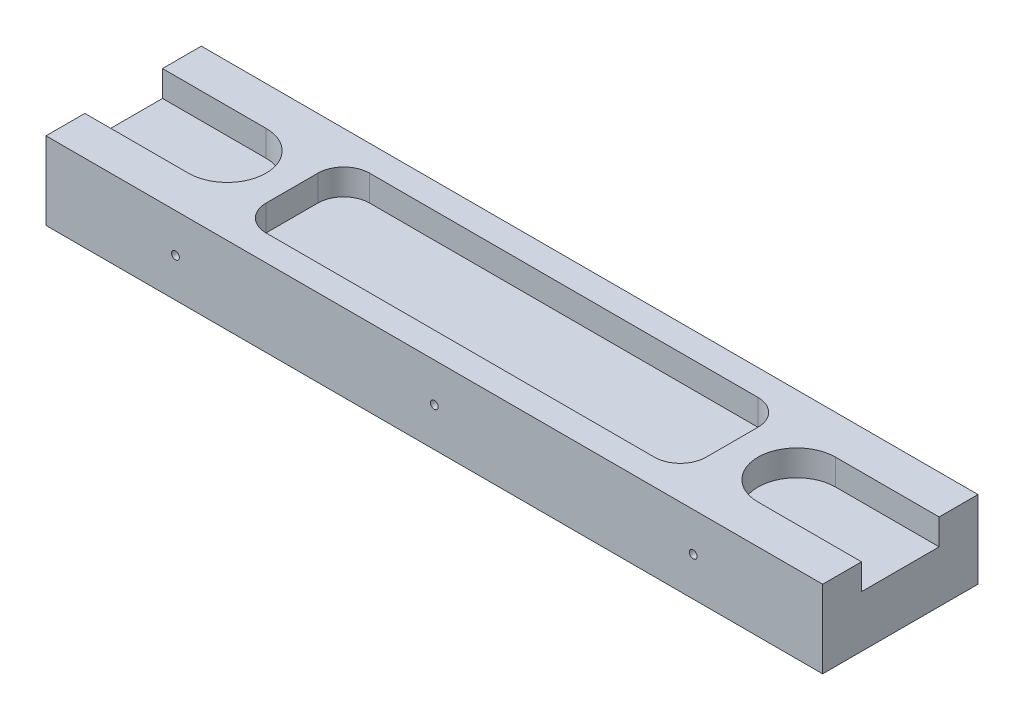
ISO-10303-21;
HEADER;
FILE_DESCRIPTION(('STEP AP214'),'2;1');
FILE_NAME('part.step','',(''),(''),'','','');
FILE_SCHEMA(('AUTOMOTIVE_DESIGN { 1 0 10303 214 1 1 1 1 }'));
ENDSEC;
DATA;
#1=APPLICATION_CONTEXT('core data for automotive mechanical design processes');
#2=APPLICATION_PROTOCOL_DEFINITION('international standard','automotive_design',2000,#1);
#3=PRODUCT_CONTEXT('',#1,'mechanical');
#4=PRODUCT('Part','Part','',(#3));
#5=PRODUCT_RELATED_PRODUCT_CATEGORY('part','',(#4));
#6=PRODUCT_DEFINITION_FORMATION('','',#4);
#7=PRODUCT_DEFINITION_CONTEXT('part definition',#1,'design');
#8=PRODUCT_DEFINITION('design','',#6,#7);
#9=PRODUCT_DEFINITION_SHAPE('','',#8);
#10=(LENGTH_UNIT() NAMED_UNIT(*) SI_UNIT(.MILLI.,.METRE.));
#11=(NAMED_UNIT(*) PLANE_ANGLE_UNIT() SI_UNIT($,.RADIAN.));
#12=(NAMED_UNIT(*) SI_UNIT($,.STERADIAN.) SOLID_ANGLE_UNIT());
#13=UNCERTAINTY_MEASURE_WITH_UNIT(LENGTH_MEASURE(1.E-05),#10,'distance_accuracy_value','');
#14=(GEOMETRIC_REPRESENTATION_CONTEXT(3) GLOBAL_UNCERTAINTY_ASSIGNED_CONTEXT((#13)) GLOBAL_UNIT_ASSIGNED_CONTEXT((#10,
#11,#12)) REPRESENTATION_CONTEXT('',''));
#15=CARTESIAN_POINT('',(0.,0.,0.));
#16=DIRECTION('',(0.,0.,1.));
#17=DIRECTION('',(1.,0.,0.));
#18=AXIS2_PLACEMENT_3D('',#15,#16,#17);
#19=CARTESIAN_POINT('',(0.,15.,0.));
#20=DIRECTION('',(1.,0.,0.));
#21=DIRECTION('',(0.,0.,-1.));
#22=AXIS2_PLACEMENT_3D('',#19,#20,#21);
#23=PLANE('',#22);
#24=DIRECTION('',(0.,0.,1.));
#25=VECTOR('',#24,1.);
#26=CARTESIAN_POINT('',(0.,10.,0.));
#27=LINE('',#26,#25);
#28=CARTESIAN_POINT('',(0.,10.,-22.5));
#29=VERTEX_POINT('',#28);
#30=CARTESIAN_POINT('',(0.,10.,-7.5));
#31=VERTEX_POINT('',#30);
#32=EDGE_CURVE('E11',#29,#31,#27,.T.);
#33=ORIENTED_EDGE('',*,*,#32,.F.);
#34=DIRECTION('',(0.,1.,0.));
#35=VECTOR('',#34,1.);
#36=CARTESIAN_POINT('',(0.,15.,-22.5));
#37=LINE('',#36,#35);
#38=CARTESIAN_POINT('',(0.,15.,-22.5));
#39=VERTEX_POINT('',#38);
#40=EDGE_CURVE('E306',#29,#39,#37,.T.);
#41=ORIENTED_EDGE('',*,*,#40,.T.);
#42=DIRECTION('',(0.,0.,1.));
#43=VECTOR('',#42,1.);
#44=CARTESIAN_POINT('',(0.,15.,0.));
#45=LINE('',#44,#43);
#46=CARTESIAN_POINT('',(0.,15.,-30.));
#47=VERTEX_POINT('',#46);
#48=EDGE_CURVE('E310',#47,#39,#45,.T.);
#49=ORIENTED_EDGE('',*,*,#48,.F.);
#50=DIRECTION('',(0.,-1.,0.));
#51=VECTOR('',#50,1.);
#52=CARTESIAN_POINT('',(0.,15.,-30.));
#53=LINE('',#52,#51);
#54=CARTESIAN_POINT('',(0.,0.,-30.));
#55=VERTEX_POINT('',#54);
#56=EDGE_CURVE('E322',#47,#55,#53,.T.);
#57=ORIENTED_EDGE('',*,*,#56,.T.);
#58=DIRECTION('',(0.,0.,1.));
#59=VECTOR('',#58,1.);
#60=CARTESIAN_POINT('',(0.,0.,0.));
#61=LINE('',#60,#59);
#62=CARTESIAN_POINT('',(0.,0.,0.));
#63=VERTEX_POINT('',#62);
#64=EDGE_CURVE('E309',#55,#63,#61,.T.);
#65=ORIENTED_EDGE('',*,*,#64,.T.);
#66=DIRECTION('',(0.,-1.,0.));
#67=VECTOR('',#66,1.);
#68=CARTESIAN_POINT('',(0.,15.,0.));
#69=LINE('',#68,#67);
#70=CARTESIAN_POINT('',(0.,15.,0.));
#71=VERTEX_POINT('',#70);
#72=EDGE_CURVE('E339',#71,#63,#69,.T.);
#73=ORIENTED_EDGE('',*,*,#72,.F.);
#74=CARTESIAN_POINT('',(0.,15.,-7.50000000000001));
#75=VERTEX_POINT('',#74);
#76=EDGE_CURVE('E314',#75,#71,#45,.T.);
#77=ORIENTED_EDGE('',*,*,#76,.F.);
#78=DIRECTION('',(0.,-1.,0.));
#79=VECTOR('',#78,1.);
#80=CARTESIAN_POINT('',(0.,15.,-7.5));
#81=LINE('',#80,#79);
#82=EDGE_CURVE('E303',#75,#31,#81,.T.);
#83=ORIENTED_EDGE('',*,*,#82,.T.);
#84=EDGE_LOOP('',(#33,#41,#49,#57,#65,#73,#77,#83));
#85=FACE_BOUND('',#84,.T.);
#86=ADVANCED_FACE('F39',(#85),#23,.F.);
#87=CARTESIAN_POINT('',(0.,15.,0.));
#88=DIRECTION('',(0.,0.,-1.));
#89=DIRECTION('',(-1.,0.,0.));
#90=AXIS2_PLACEMENT_3D('',#87,#88,#89);
#91=PLANE('',#90);
#92=CARTESIAN_POINT('',(25.,7.5,0.));
#93=DIRECTION('',(0.,0.,1.));
#94=DIRECTION('',(1.,0.,0.));
#95=AXIS2_PLACEMENT_3D('',#92,#93,#94);
#96=CIRCLE('',#95,0.750000000000002);
#97=CARTESIAN_POINT('',(25.75,7.5,0.));
#98=VERTEX_POINT('',#97);
#99=EDGE_CURVE('E246',#98,#98,#96,.T.);
#100=ORIENTED_EDGE('',*,*,#99,.F.);
#101=EDGE_LOOP('',(#100));
#102=FACE_BOUND('',#101,.T.);
#103=CARTESIAN_POINT('',(75.,7.5,0.));
#104=DIRECTION('',(0.,0.,1.));
#105=DIRECTION('',(1.,0.,0.));
#106=AXIS2_PLACEMENT_3D('',#103,#104,#105);
#107=CIRCLE('',#106,0.749999999999999);
#108=CARTESIAN_POINT('',(75.75,7.5,0.));
#109=VERTEX_POINT('',#108);
#110=EDGE_CURVE('E250',#109,#109,#107,.T.);
#111=ORIENTED_EDGE('',*,*,#110,.F.);
#112=EDGE_LOOP('',(#111));
#113=FACE_BOUND('',#112,.T.);
#114=CARTESIAN_POINT('',(125.,7.5,0.));
#115=DIRECTION('',(0.,0.,1.));
#116=DIRECTION('',(1.,0.,0.));
#117=AXIS2_PLACEMENT_3D('',#114,#115,#116);
#118=CIRCLE('',#117,0.750000000000012);
#119=CARTESIAN_POINT('',(125.75,7.5,0.));
#120=VERTEX_POINT('',#119);
#121=EDGE_CURVE('E257',#120,#120,#118,.T.);
#122=ORIENTED_EDGE('',*,*,#121,.F.);
#123=EDGE_LOOP('',(#122));
#124=FACE_BOUND('',#123,.T.);
#125=DIRECTION('',(1.,0.,0.));
#126=VECTOR('',#125,1.);
#127=CARTESIAN_POINT('',(0.,0.,0.));
#128=LINE('',#127,#126);
#129=CARTESIAN_POINT('',(150.,0.,0.));
#130=VERTEX_POINT('',#129);
#131=EDGE_CURVE('E325',#63,#130,#128,.T.);
#132=ORIENTED_EDGE('',*,*,#131,.T.);
#133=DIRECTION('',(0.,-1.,0.));
#134=VECTOR('',#133,1.);
#135=CARTESIAN_POINT('',(150.,15.,0.));
#136=LINE('',#135,#134);
#137=CARTESIAN_POINT('',(150.,15.,0.));
#138=VERTEX_POINT('',#137);
#139=EDGE_CURVE('E336',#138,#130,#136,.T.);
#140=ORIENTED_EDGE('',*,*,#139,.F.);
#141=DIRECTION('',(1.,0.,0.));
#142=VECTOR('',#141,1.);
#143=CARTESIAN_POINT('',(0.,15.,0.));
#144=LINE('',#143,#142);
#145=EDGE_CURVE('E313',#71,#138,#144,.T.);
#146=ORIENTED_EDGE('',*,*,#145,.F.);
#147=ORIENTED_EDGE('',*,*,#72,.T.);
#148=EDGE_LOOP('',(#132,#140,#146,#147));
#149=FACE_BOUND('',#148,.T.);
#150=ADVANCED_FACE('F395',(#102,#113,#124,#149),#91,.F.);
#151=CARTESIAN_POINT('',(150.,15.,0.));
#152=DIRECTION('',(-1.,0.,0.));
#153=DIRECTION('',(0.,0.,1.));
#154=AXIS2_PLACEMENT_3D('',#151,#152,#153);
#155=PLANE('',#154);
#156=DIRECTION('',(0.,0.,1.));
#157=VECTOR('',#156,1.);
#158=CARTESIAN_POINT('',(150.,10.,0.));
#159=LINE('',#158,#157);
#160=CARTESIAN_POINT('',(150.,10.,-22.5));
#161=VERTEX_POINT('',#160);
#162=CARTESIAN_POINT('',(150.,10.,-7.5));
#163=VERTEX_POINT('',#162);
#164=EDGE_CURVE('E46',#161,#163,#159,.T.);
#165=ORIENTED_EDGE('',*,*,#164,.T.);
#166=DIRECTION('',(0.,1.,0.));
#167=VECTOR('',#166,1.);
#168=CARTESIAN_POINT('',(150.,15.,-7.5));
#169=LINE('',#168,#167);
#170=CARTESIAN_POINT('',(150.,15.,-7.5));
#171=VERTEX_POINT('',#170);
#172=EDGE_CURVE('E300',#163,#171,#169,.T.);
#173=ORIENTED_EDGE('',*,*,#172,.T.);
#174=DIRECTION('',(0.,0.,-1.));
#175=VECTOR('',#174,1.);
#176=CARTESIAN_POINT('',(150.,15.,0.));
#177=LINE('',#176,#175);
#178=EDGE_CURVE('E317',#138,#171,#177,.T.);
#179=ORIENTED_EDGE('',*,*,#178,.F.);
#180=ORIENTED_EDGE('',*,*,#139,.T.);
#181=DIRECTION('',(0.,0.,-1.));
#182=VECTOR('',#181,1.);
#183=CARTESIAN_POINT('',(150.,0.,0.));
#184=LINE('',#183,#182);
#185=CARTESIAN_POINT('',(150.,0.,-30.));
#186=VERTEX_POINT('',#185);
#187=EDGE_CURVE('E327',#130,#186,#184,.T.);
#188=ORIENTED_EDGE('',*,*,#187,.T.);
#189=DIRECTION('',(0.,-1.,0.));
#190=VECTOR('',#189,1.);
#191=CARTESIAN_POINT('',(150.,15.,-30.));
#192=LINE('',#191,#190);
#193=CARTESIAN_POINT('',(150.,15.,-30.));
#194=VERTEX_POINT('',#193);
#195=EDGE_CURVE('E333',#194,#186,#192,.T.);
#196=ORIENTED_EDGE('',*,*,#195,.F.);
#197=CARTESIAN_POINT('',(150.,15.,-22.5));
#198=VERTEX_POINT('',#197);
#199=EDGE_CURVE('E316',#198,#194,#177,.T.);
#200=ORIENTED_EDGE('',*,*,#199,.F.);
#201=DIRECTION('',(0.,-1.,0.));
#202=VECTOR('',#201,1.);
#203=CARTESIAN_POINT('',(150.,15.,-22.5));
#204=LINE('',#203,#202);
#205=EDGE_CURVE('E61',#198,#161,#204,.T.);
#206=ORIENTED_EDGE('',*,*,#205,.T.);
#207=EDGE_LOOP('',(#165,#173,#179,#180,#188,#196,#200,#206));
#208=FACE_BOUND('',#207,.T.);
#209=ADVANCED_FACE('F348',(#208),#155,.F.);
#210=CARTESIAN_POINT('',(0.,15.,-30.));
#211=DIRECTION('',(0.,0.,1.));
#212=DIRECTION('',(1.,0.,0.));
#213=AXIS2_PLACEMENT_3D('',#210,#211,#212);
#214=PLANE('',#213);
#215=CARTESIAN_POINT('',(25.,7.5,-30.));
#216=DIRECTION('',(0.,0.,1.));
#217=DIRECTION('',(1.,0.,0.));
#218=AXIS2_PLACEMENT_3D('',#215,#216,#217);
#219=CIRCLE('',#218,0.750000000000002);
#220=CARTESIAN_POINT('',(25.75,7.5,-30.));
#221=VERTEX_POINT('',#220);
#222=EDGE_CURVE('E249',#221,#221,#219,.F.);
#223=ORIENTED_EDGE('',*,*,#222,.F.);
#224=EDGE_LOOP('',(#223));
#225=FACE_BOUND('',#224,.T.);
#226=CARTESIAN_POINT('',(75.,7.5,-30.));
#227=DIRECTION('',(0.,0.,1.));
#228=DIRECTION('',(1.,0.,0.));
#229=AXIS2_PLACEMENT_3D('',#226,#227,#228);
#230=CIRCLE('',#229,0.749999999999999);
#231=CARTESIAN_POINT('',(75.75,7.5,-30.));
#232=VERTEX_POINT('',#231);
#233=EDGE_CURVE('E254',#232,#232,#230,.F.);
#234=ORIENTED_EDGE('',*,*,#233,.F.);
#235=EDGE_LOOP('',(#234));
#236=FACE_BOUND('',#235,.T.);
#237=CARTESIAN_POINT('',(125.,7.5,-30.));
#238=DIRECTION('',(0.,0.,1.));
#239=DIRECTION('',(1.,0.,0.));
#240=AXIS2_PLACEMENT_3D('',#237,#238,#239);
#241=CIRCLE('',#240,0.750000000000012);
#242=CARTESIAN_POINT('',(125.75,7.5,-30.));
#243=VERTEX_POINT('',#242);
#244=EDGE_CURVE('E234',#243,#243,#241,.F.);
#245=ORIENTED_EDGE('',*,*,#244,.F.);
#246=EDGE_LOOP('',(#245));
#247=FACE_BOUND('',#246,.T.);
#248=DIRECTION('',(-1.,0.,0.));
#249=VECTOR('',#248,1.);
#250=CARTESIAN_POINT('',(0.,0.,-30.));
#251=LINE('',#250,#249);
#252=EDGE_CURVE('E329',#186,#55,#251,.T.);
#253=ORIENTED_EDGE('',*,*,#252,.T.);
#254=ORIENTED_EDGE('',*,*,#56,.F.);
#255=DIRECTION('',(-1.,0.,0.));
#256=VECTOR('',#255,1.);
#257=CARTESIAN_POINT('',(0.,15.,-30.));
#258=LINE('',#257,#256);
#259=EDGE_CURVE('E320',#194,#47,#258,.T.);
#260=ORIENTED_EDGE('',*,*,#259,.F.);
#261=ORIENTED_EDGE('',*,*,#195,.T.);
#262=EDGE_LOOP('',(#253,#254,#260,#261));
#263=FACE_BOUND('',#262,.T.);
#264=ADVANCED_FACE('F376',(#225,#236,#247,#263),#214,.F.);
#265=CARTESIAN_POINT('',(0.,15.,0.));
#266=DIRECTION('',(0.,-1.,0.));
#267=DIRECTION('',(0.,0.,-1.));
#268=AXIS2_PLACEMENT_3D('',#265,#266,#267);
#269=PLANE('',#268);
#270=DIRECTION('',(-1.,0.,0.));
#271=VECTOR('',#270,1.);
#272=CARTESIAN_POINT('',(37.5,15.,-25.));
#273=LINE('',#272,#271);
#274=CARTESIAN_POINT('',(112.5,15.,-25.));
#275=VERTEX_POINT('',#274);
#276=CARTESIAN_POINT('',(37.5,15.,-25.));
#277=VERTEX_POINT('',#276);
#278=EDGE_CURVE('E216',#275,#277,#273,.T.);
#279=ORIENTED_EDGE('',*,*,#278,.F.);
#280=CARTESIAN_POINT('',(112.5,15.,-20.));
#281=DIRECTION('',(0.,1.,0.));
#282=DIRECTION('',(0.,0.,-1.));
#283=AXIS2_PLACEMENT_3D('',#280,#281,#282);
#284=CIRCLE('',#283,5.);
#285=CARTESIAN_POINT('',(117.5,15.,-20.));
#286=VERTEX_POINT('',#285);
#287=EDGE_CURVE('E53',#286,#275,#284,.T.);
#288=ORIENTED_EDGE('',*,*,#287,.F.);
#289=DIRECTION('',(0.,0.,-1.));
#290=VECTOR('',#289,1.);
#291=CARTESIAN_POINT('',(117.5,15.,-20.));
#292=LINE('',#291,#290);
#293=CARTESIAN_POINT('',(117.5,15.,-10.));
#294=VERTEX_POINT('',#293);
#295=EDGE_CURVE('E196',#294,#286,#292,.T.);
#296=ORIENTED_EDGE('',*,*,#295,.F.);
#297=CARTESIAN_POINT('',(112.5,15.,-10.));
#298=DIRECTION('',(0.,1.,0.));
#299=DIRECTION('',(0.,0.,1.));
#300=AXIS2_PLACEMENT_3D('',#297,#298,#299);
#301=CIRCLE('',#300,5.);
#302=CARTESIAN_POINT('',(112.5,15.,-5.));
#303=VERTEX_POINT('',#302);
#304=EDGE_CURVE('E199',#303,#294,#301,.T.);
#305=ORIENTED_EDGE('',*,*,#304,.F.);
#306=DIRECTION('',(1.,0.,0.));
#307=VECTOR('',#306,1.);
#308=CARTESIAN_POINT('',(37.5,15.,-5.));
#309=LINE('',#308,#307);
#310=CARTESIAN_POINT('',(37.5,15.,-5.));
#311=VERTEX_POINT('',#310);
#312=EDGE_CURVE('E227',#311,#303,#309,.T.);
#313=ORIENTED_EDGE('',*,*,#312,.F.);
#314=CARTESIAN_POINT('',(37.5,15.,-10.));
#315=DIRECTION('',(0.,1.,0.));
#316=DIRECTION('',(0.,0.,1.));
#317=AXIS2_PLACEMENT_3D('',#314,#315,#316);
#318=CIRCLE('',#317,5.);
#319=CARTESIAN_POINT('',(32.5,15.,-10.));
#320=VERTEX_POINT('',#319);
#321=EDGE_CURVE('E224',#320,#311,#318,.T.);
#322=ORIENTED_EDGE('',*,*,#321,.F.);
#323=DIRECTION('',(0.,0.,1.));
#324=VECTOR('',#323,1.);
#325=CARTESIAN_POINT('',(32.5,15.,-20.));
#326=LINE('',#325,#324);
#327=CARTESIAN_POINT('',(32.5,15.,-20.));
#328=VERTEX_POINT('',#327);
#329=EDGE_CURVE('E221',#328,#320,#326,.T.);
#330=ORIENTED_EDGE('',*,*,#329,.F.);
#331=CARTESIAN_POINT('',(37.5,15.,-20.));
#332=DIRECTION('',(0.,1.,0.));
#333=DIRECTION('',(0.,0.,1.));
#334=AXIS2_PLACEMENT_3D('',#331,#332,#333);
#335=CIRCLE('',#334,5.);
#336=EDGE_CURVE('E218',#277,#328,#335,.T.);
#337=ORIENTED_EDGE('',*,*,#336,.F.);
#338=EDGE_LOOP('',(#279,#288,#296,#305,#313,#322,#330,#337));
#339=FACE_BOUND('',#338,.T.);
#340=ORIENTED_EDGE('',*,*,#48,.T.);
#341=DIRECTION('',(-1.,0.,0.));
#342=VECTOR('',#341,1.);
#343=CARTESIAN_POINT('',(-20.,15.,-22.5));
#344=LINE('',#343,#342);
#345=CARTESIAN_POINT('',(20.,15.,-22.5));
#346=VERTEX_POINT('',#345);
#347=EDGE_CURVE('E267',#346,#39,#344,.T.);
#348=ORIENTED_EDGE('',*,*,#347,.F.);
#349=CARTESIAN_POINT('',(20.,15.,-15.));
#350=DIRECTION('',(0.,1.,0.));
#351=DIRECTION('',(0.,0.,1.));
#352=AXIS2_PLACEMENT_3D('',#349,#350,#351);
#353=CIRCLE('',#352,7.5);
#354=CARTESIAN_POINT('',(20.,15.,-7.50000000000001));
#355=VERTEX_POINT('',#354);
#356=EDGE_CURVE('E274',#355,#346,#353,.T.);
#357=ORIENTED_EDGE('',*,*,#356,.F.);
#358=DIRECTION('',(-1.,0.,0.));
#359=VECTOR('',#358,1.);
#360=CARTESIAN_POINT('',(0.,15.,-7.5));
#361=LINE('',#360,#359);
#362=EDGE_CURVE('E344',#355,#75,#361,.T.);
#363=ORIENTED_EDGE('',*,*,#362,.T.);
#364=ORIENTED_EDGE('',*,*,#76,.T.);
#365=ORIENTED_EDGE('',*,*,#145,.T.);
#366=ORIENTED_EDGE('',*,*,#178,.T.);
#367=DIRECTION('',(1.,0.,0.));
#368=VECTOR('',#367,1.);
#369=CARTESIAN_POINT('',(170.,15.,-7.5));
#370=LINE('',#369,#368);
#371=CARTESIAN_POINT('',(130.,15.,-7.50000000000001));
#372=VERTEX_POINT('',#371);
#373=EDGE_CURVE('E288',#372,#171,#370,.T.);
#374=ORIENTED_EDGE('',*,*,#373,.F.);
#375=CARTESIAN_POINT('',(130.,15.,-15.));
#376=DIRECTION('',(0.,1.,0.));
#377=DIRECTION('',(0.,0.,-1.));
#378=AXIS2_PLACEMENT_3D('',#375,#376,#377);
#379=CIRCLE('',#378,7.5);
#380=CARTESIAN_POINT('',(130.,15.,-22.5));
#381=VERTEX_POINT('',#380);
#382=EDGE_CURVE('E277',#381,#372,#379,.T.);
#383=ORIENTED_EDGE('',*,*,#382,.F.);
#384=DIRECTION('',(1.,0.,0.));
#385=VECTOR('',#384,1.);
#386=CARTESIAN_POINT('',(0.,15.,-22.5));
#387=LINE('',#386,#385);
#388=EDGE_CURVE('E342',#381,#198,#387,.T.);
#389=ORIENTED_EDGE('',*,*,#388,.T.);
#390=ORIENTED_EDGE('',*,*,#199,.T.);
#391=ORIENTED_EDGE('',*,*,#259,.T.);
#392=EDGE_LOOP('',(#340,#348,#357,#363,#364,#365,#366,#374,#383,#389,#390,#391));
#393=FACE_BOUND('',#392,.T.);
#394=ADVANCED_FACE('F364',(#339,#393),#269,.F.);
#395=CARTESIAN_POINT('',(0.,0.,0.));
#396=DIRECTION('',(0.,-1.,0.));
#397=DIRECTION('',(0.,0.,-1.));
#398=AXIS2_PLACEMENT_3D('',#395,#396,#397);
#399=PLANE('',#398);
#400=ORIENTED_EDGE('',*,*,#64,.F.);
#401=ORIENTED_EDGE('',*,*,#252,.F.);
#402=ORIENTED_EDGE('',*,*,#187,.F.);
#403=ORIENTED_EDGE('',*,*,#131,.F.);
#404=EDGE_LOOP('',(#400,#401,#402,#403));
#405=FACE_BOUND('',#404,.T.);
#406=ADVANCED_FACE('F373',(#405),#399,.T.);
#407=CARTESIAN_POINT('',(170.,10.,-15.));
#408=DIRECTION('',(0.,-1.,0.));
#409=DIRECTION('',(0.,0.,-1.));
#410=AXIS2_PLACEMENT_3D('',#407,#408,#409);
#411=PLANE('',#410);
#412=DIRECTION('',(-1.,0.,0.));
#413=VECTOR('',#412,1.);
#414=CARTESIAN_POINT('',(170.,10.,-22.5));
#415=LINE('',#414,#413);
#416=CARTESIAN_POINT('',(130.,10.,-22.5));
#417=VERTEX_POINT('',#416);
#418=EDGE_CURVE('E290',#161,#417,#415,.T.);
#419=ORIENTED_EDGE('',*,*,#418,.T.);
#420=CARTESIAN_POINT('',(130.,10.,-15.));
#421=DIRECTION('',(0.,1.,0.));
#422=DIRECTION('',(0.,0.,-1.));
#423=AXIS2_PLACEMENT_3D('',#420,#421,#422);
#424=CIRCLE('',#423,7.5);
#425=CARTESIAN_POINT('',(130.,10.,-7.50000000000001));
#426=VERTEX_POINT('',#425);
#427=EDGE_CURVE('E295',#417,#426,#424,.T.);
#428=ORIENTED_EDGE('',*,*,#427,.T.);
#429=DIRECTION('',(1.,0.,0.));
#430=VECTOR('',#429,1.);
#431=CARTESIAN_POINT('',(170.,10.,-7.5));
#432=LINE('',#431,#430);
#433=EDGE_CURVE('E286',#426,#163,#432,.T.);
#434=ORIENTED_EDGE('',*,*,#433,.T.);
#435=ORIENTED_EDGE('',*,*,#164,.F.);
#436=EDGE_LOOP('',(#419,#428,#434,#435));
#437=FACE_BOUND('',#436,.T.);
#438=ADVANCED_FACE('F352',(#437),#411,.F.);
#439=CARTESIAN_POINT('',(170.,10.,-7.5));
#440=DIRECTION('',(0.,0.,1.));
#441=DIRECTION('',(1.,0.,0.));
#442=AXIS2_PLACEMENT_3D('',#439,#440,#441);
#443=PLANE('',#442);
#444=ORIENTED_EDGE('',*,*,#433,.F.);
#445=DIRECTION('',(0.,1.,0.));
#446=VECTOR('',#445,1.);
#447=CARTESIAN_POINT('',(130.,10.,-7.50000000000001));
#448=LINE('',#447,#446);
#449=EDGE_CURVE('E253',#426,#372,#448,.T.);
#450=ORIENTED_EDGE('',*,*,#449,.T.);
#451=ORIENTED_EDGE('',*,*,#373,.T.);
#452=ORIENTED_EDGE('',*,*,#172,.F.);
#453=EDGE_LOOP('',(#444,#450,#451,#452));
#454=FACE_BOUND('',#453,.T.);
#455=ADVANCED_FACE('F361',(#454),#443,.F.);
#456=CARTESIAN_POINT('',(170.,10.,-22.5));
#457=DIRECTION('',(0.,0.,-1.));
#458=DIRECTION('',(-1.,0.,0.));
#459=AXIS2_PLACEMENT_3D('',#456,#457,#458);
#460=PLANE('',#459);
#461=ORIENTED_EDGE('',*,*,#388,.F.);
#462=DIRECTION('',(0.,1.,0.));
#463=VECTOR('',#462,1.);
#464=CARTESIAN_POINT('',(130.,10.,-22.5));
#465=LINE('',#464,#463);
#466=EDGE_CURVE('E283',#417,#381,#465,.T.);
#467=ORIENTED_EDGE('',*,*,#466,.F.);
#468=ORIENTED_EDGE('',*,*,#418,.F.);
#469=ORIENTED_EDGE('',*,*,#205,.F.);
#470=EDGE_LOOP('',(#461,#467,#468,#469));
#471=FACE_BOUND('',#470,.T.);
#472=ADVANCED_FACE('F355',(#471),#460,.F.);
#473=CARTESIAN_POINT('',(130.,10.,-15.));
#474=DIRECTION('',(0.,1.,0.));
#475=DIRECTION('',(0.,0.,1.));
#476=AXIS2_PLACEMENT_3D('',#473,#474,#475);
#477=CYLINDRICAL_SURFACE('',#476,7.5);
#478=ORIENTED_EDGE('',*,*,#382,.T.);
#479=ORIENTED_EDGE('',*,*,#449,.F.);
#480=ORIENTED_EDGE('',*,*,#427,.F.);
#481=ORIENTED_EDGE('',*,*,#466,.T.);
#482=EDGE_LOOP('',(#478,#479,#480,#481));
#483=FACE_BOUND('',#482,.T.);
#484=ADVANCED_FACE('F359',(#483),#477,.F.);
#485=CARTESIAN_POINT('',(-20.,10.,-15.));
#486=DIRECTION('',(0.,1.,0.));
#487=DIRECTION('',(0.,0.,1.));
#488=AXIS2_PLACEMENT_3D('',#485,#486,#487);
#489=PLANE('',#488);
#490=ORIENTED_EDGE('',*,*,#32,.T.);
#491=DIRECTION('',(1.,0.,0.));
#492=VECTOR('',#491,1.);
#493=CARTESIAN_POINT('',(-20.,10.,-7.5));
#494=LINE('',#493,#492);
#495=CARTESIAN_POINT('',(20.,10.,-7.50000000000001));
#496=VERTEX_POINT('',#495);
#497=EDGE_CURVE('E264',#31,#496,#494,.T.);
#498=ORIENTED_EDGE('',*,*,#497,.T.);
#499=CARTESIAN_POINT('',(20.,10.,-15.));
#500=DIRECTION('',(0.,1.,0.));
#501=DIRECTION('',(0.,0.,1.));
#502=AXIS2_PLACEMENT_3D('',#499,#500,#501);
#503=CIRCLE('',#502,7.5);
#504=CARTESIAN_POINT('',(20.,10.,-22.5));
#505=VERTEX_POINT('',#504);
#506=EDGE_CURVE('E266',#496,#505,#503,.T.);
#507=ORIENTED_EDGE('',*,*,#506,.T.);
#508=DIRECTION('',(-1.,0.,0.));
#509=VECTOR('',#508,1.);
#510=CARTESIAN_POINT('',(-20.,10.,-22.5));
#511=LINE('',#510,#509);
#512=EDGE_CURVE('E270',#505,#29,#511,.T.);
#513=ORIENTED_EDGE('',*,*,#512,.T.);
#514=EDGE_LOOP('',(#490,#498,#507,#513));
#515=FACE_BOUND('',#514,.T.);
#516=ADVANCED_FACE('F421',(#515),#489,.T.);
#517=CARTESIAN_POINT('',(-20.,10.,-22.5));
#518=DIRECTION('',(0.,0.,-1.));
#519=DIRECTION('',(-1.,0.,0.));
#520=AXIS2_PLACEMENT_3D('',#517,#518,#519);
#521=PLANE('',#520);
#522=ORIENTED_EDGE('',*,*,#512,.F.);
#523=DIRECTION('',(0.,1.,0.));
#524=VECTOR('',#523,1.);
#525=CARTESIAN_POINT('',(20.,10.,-22.5));
#526=LINE('',#525,#524);
#527=EDGE_CURVE('E279',#505,#346,#526,.T.);
#528=ORIENTED_EDGE('',*,*,#527,.T.);
#529=ORIENTED_EDGE('',*,*,#347,.T.);
#530=ORIENTED_EDGE('',*,*,#40,.F.);
#531=EDGE_LOOP('',(#522,#528,#529,#530));
#532=FACE_BOUND('',#531,.T.);
#533=ADVANCED_FACE('F386',(#532),#521,.F.);
#534=CARTESIAN_POINT('',(-20.,10.,-7.5));
#535=DIRECTION('',(0.,0.,1.));
#536=DIRECTION('',(1.,0.,0.));
#537=AXIS2_PLACEMENT_3D('',#534,#535,#536);
#538=PLANE('',#537);
#539=ORIENTED_EDGE('',*,*,#362,.F.);
#540=DIRECTION('',(0.,1.,0.));
#541=VECTOR('',#540,1.);
#542=CARTESIAN_POINT('',(20.,10.,-7.50000000000001));
#543=LINE('',#542,#541);
#544=EDGE_CURVE('E273',#496,#355,#543,.T.);
#545=ORIENTED_EDGE('',*,*,#544,.F.);
#546=ORIENTED_EDGE('',*,*,#497,.F.);
#547=ORIENTED_EDGE('',*,*,#82,.F.);
#548=EDGE_LOOP('',(#539,#545,#546,#547));
#549=FACE_BOUND('',#548,.T.);
#550=ADVANCED_FACE('F393',(#549),#538,.F.);
#551=CARTESIAN_POINT('',(20.,10.,-15.));
#552=DIRECTION('',(0.,1.,0.));
#553=DIRECTION('',(0.,0.,1.));
#554=AXIS2_PLACEMENT_3D('',#551,#552,#553);
#555=CYLINDRICAL_SURFACE('',#554,7.5);
#556=ORIENTED_EDGE('',*,*,#356,.T.);
#557=ORIENTED_EDGE('',*,*,#527,.F.);
#558=ORIENTED_EDGE('',*,*,#506,.F.);
#559=ORIENTED_EDGE('',*,*,#544,.T.);
#560=EDGE_LOOP('',(#556,#557,#558,#559));
#561=FACE_BOUND('',#560,.T.);
#562=ADVANCED_FACE('F389',(#561),#555,.F.);
#563=CARTESIAN_POINT('',(125.,7.5,-32.1213203435597));
#564=DIRECTION('',(0.,0.,1.));
#565=DIRECTION('',(1.,0.,0.));
#566=AXIS2_PLACEMENT_3D('',#563,#564,#565);
#567=CYLINDRICAL_SURFACE('',#566,0.750000000000012);
#568=ORIENTED_EDGE('',*,*,#244,.T.);
#569=EDGE_LOOP('',(#568));
#570=FACE_BOUND('',#569,.T.);
#571=ORIENTED_EDGE('',*,*,#121,.T.);
#572=EDGE_LOOP('',(#571));
#573=FACE_BOUND('',#572,.T.);
#574=ADVANCED_FACE('F427',(#570,#573),#567,.F.);
#575=CARTESIAN_POINT('',(75.,7.5,-32.1213203435597));
#576=DIRECTION('',(0.,0.,1.));
#577=DIRECTION('',(1.,0.,0.));
#578=AXIS2_PLACEMENT_3D('',#575,#576,#577);
#579=CYLINDRICAL_SURFACE('',#578,0.749999999999999);
#580=ORIENTED_EDGE('',*,*,#233,.T.);
#581=EDGE_LOOP('',(#580));
#582=FACE_BOUND('',#581,.T.);
#583=ORIENTED_EDGE('',*,*,#110,.T.);
#584=EDGE_LOOP('',(#583));
#585=FACE_BOUND('',#584,.T.);
#586=ADVANCED_FACE('F435',(#582,#585),#579,.F.);
#587=CARTESIAN_POINT('',(25.,7.5,-32.1213203435597));
#588=DIRECTION('',(0.,0.,1.));
#589=DIRECTION('',(1.,0.,0.));
#590=AXIS2_PLACEMENT_3D('',#587,#588,#589);
#591=CYLINDRICAL_SURFACE('',#590,0.750000000000002);
#592=ORIENTED_EDGE('',*,*,#222,.T.);
#593=EDGE_LOOP('',(#592));
#594=FACE_BOUND('',#593,.T.);
#595=ORIENTED_EDGE('',*,*,#99,.T.);
#596=EDGE_LOOP('',(#595));
#597=FACE_BOUND('',#596,.T.);
#598=ADVANCED_FACE('F439',(#594,#597),#591,.F.);
#599=CARTESIAN_POINT('',(112.5,10.,-20.));
#600=DIRECTION('',(0.,1.,0.));
#601=DIRECTION('',(0.,0.,1.));
#602=AXIS2_PLACEMENT_3D('',#599,#600,#601);
#603=CYLINDRICAL_SURFACE('',#602,5.);
#604=ORIENTED_EDGE('',*,*,#287,.T.);
#605=DIRECTION('',(0.,1.,0.));
#606=VECTOR('',#605,1.);
#607=CARTESIAN_POINT('',(112.5,10.,-25.));
#608=LINE('',#607,#606);
#609=CARTESIAN_POINT('',(112.5,10.,-25.));
#610=VERTEX_POINT('',#609);
#611=EDGE_CURVE('E173',#610,#275,#608,.T.);
#612=ORIENTED_EDGE('',*,*,#611,.F.);
#613=CARTESIAN_POINT('',(112.5,10.,-20.));
#614=DIRECTION('',(0.,1.,0.));
#615=DIRECTION('',(0.,0.,-1.));
#616=AXIS2_PLACEMENT_3D('',#613,#614,#615);
#617=CIRCLE('',#616,5.);
#618=CARTESIAN_POINT('',(117.5,10.,-20.));
#619=VERTEX_POINT('',#618);
#620=EDGE_CURVE('E177',#619,#610,#617,.T.);
#621=ORIENTED_EDGE('',*,*,#620,.F.);
#622=DIRECTION('',(0.,1.,0.));
#623=VECTOR('',#622,1.);
#624=CARTESIAN_POINT('',(117.5,10.,-20.));
#625=LINE('',#624,#623);
#626=EDGE_CURVE('E232',#619,#286,#625,.T.);
#627=ORIENTED_EDGE('',*,*,#626,.T.);
#628=EDGE_LOOP('',(#604,#612,#621,#627));
#629=FACE_BOUND('',#628,.T.);
#630=ADVANCED_FACE('F175',(#629),#603,.F.);
#631=CARTESIAN_POINT('',(117.5,10.,-20.));
#632=DIRECTION('',(1.,0.,0.));
#633=DIRECTION('',(0.,0.,-1.));
#634=AXIS2_PLACEMENT_3D('',#631,#632,#633);
#635=PLANE('',#634);
#636=ORIENTED_EDGE('',*,*,#295,.T.);
#637=ORIENTED_EDGE('',*,*,#626,.F.);
#638=DIRECTION('',(0.,0.,-1.));
#639=VECTOR('',#638,1.);
#640=CARTESIAN_POINT('',(117.5,10.,-20.));
#641=LINE('',#640,#639);
#642=CARTESIAN_POINT('',(117.5,10.,-10.));
#643=VERTEX_POINT('',#642);
#644=EDGE_CURVE('E183',#643,#619,#641,.T.);
#645=ORIENTED_EDGE('',*,*,#644,.F.);
#646=DIRECTION('',(0.,1.,0.));
#647=VECTOR('',#646,1.);
#648=CARTESIAN_POINT('',(117.5,10.,-10.));
#649=LINE('',#648,#647);
#650=EDGE_CURVE('E235',#643,#294,#649,.T.);
#651=ORIENTED_EDGE('',*,*,#650,.T.);
#652=EDGE_LOOP('',(#636,#637,#645,#651));
#653=FACE_BOUND('',#652,.T.);
#654=ADVANCED_FACE('F446',(#653),#635,.F.);
#655=CARTESIAN_POINT('',(112.5,10.,-10.));
#656=DIRECTION('',(0.,1.,0.));
#657=DIRECTION('',(0.,0.,1.));
#658=AXIS2_PLACEMENT_3D('',#655,#656,#657);
#659=CYLINDRICAL_SURFACE('',#658,5.);
#660=ORIENTED_EDGE('',*,*,#304,.T.);
#661=ORIENTED_EDGE('',*,*,#650,.F.);
#662=CARTESIAN_POINT('',(112.5,10.,-10.));
#663=DIRECTION('',(0.,1.,0.));
#664=DIRECTION('',(0.,0.,1.));
#665=AXIS2_PLACEMENT_3D('',#662,#663,#664);
#666=CIRCLE('',#665,5.);
#667=CARTESIAN_POINT('',(112.5,10.,-5.));
#668=VERTEX_POINT('',#667);
#669=EDGE_CURVE('E212',#668,#643,#666,.T.);
#670=ORIENTED_EDGE('',*,*,#669,.F.);
#671=DIRECTION('',(0.,1.,0.));
#672=VECTOR('',#671,1.);
#673=CARTESIAN_POINT('',(112.5,10.,-5.));
#674=LINE('',#673,#672);
#675=EDGE_CURVE('E237',#668,#303,#674,.T.);
#676=ORIENTED_EDGE('',*,*,#675,.T.);
#677=EDGE_LOOP('',(#660,#661,#670,#676));
#678=FACE_BOUND('',#677,.T.);
#679=ADVANCED_FACE('F464',(#678),#659,.F.);
#680=CARTESIAN_POINT('',(37.5,10.,-5.));
#681=DIRECTION('',(0.,0.,1.));
#682=DIRECTION('',(1.,0.,0.));
#683=AXIS2_PLACEMENT_3D('',#680,#681,#682);
#684=PLANE('',#683);
#685=ORIENTED_EDGE('',*,*,#312,.T.);
#686=ORIENTED_EDGE('',*,*,#675,.F.);
#687=DIRECTION('',(1.,0.,0.));
#688=VECTOR('',#687,1.);
#689=CARTESIAN_POINT('',(37.5,10.,-5.));
#690=LINE('',#689,#688);
#691=CARTESIAN_POINT('',(37.5,10.,-5.));
#692=VERTEX_POINT('',#691);
#693=EDGE_CURVE('E209',#692,#668,#690,.T.);
#694=ORIENTED_EDGE('',*,*,#693,.F.);
#695=DIRECTION('',(0.,1.,0.));
#696=VECTOR('',#695,1.);
#697=CARTESIAN_POINT('',(37.5,10.,-5.));
#698=LINE('',#697,#696);
#699=EDGE_CURVE('E239',#692,#311,#698,.T.);
#700=ORIENTED_EDGE('',*,*,#699,.T.);
#701=EDGE_LOOP('',(#685,#686,#694,#700));
#702=FACE_BOUND('',#701,.T.);
#703=ADVANCED_FACE('F460',(#702),#684,.F.);
#704=CARTESIAN_POINT('',(37.5,10.,-10.));
#705=DIRECTION('',(0.,1.,0.));
#706=DIRECTION('',(0.,0.,1.));
#707=AXIS2_PLACEMENT_3D('',#704,#705,#706);
#708=CYLINDRICAL_SURFACE('',#707,5.);
#709=ORIENTED_EDGE('',*,*,#321,.T.);
#710=ORIENTED_EDGE('',*,*,#699,.F.);
#711=CARTESIAN_POINT('',(37.5,10.,-10.));
#712=DIRECTION('',(0.,1.,0.));
#713=DIRECTION('',(0.,0.,1.));
#714=AXIS2_PLACEMENT_3D('',#711,#712,#713);
#715=CIRCLE('',#714,5.);
#716=CARTESIAN_POINT('',(32.5,10.,-10.));
#717=VERTEX_POINT('',#716);
#718=EDGE_CURVE('E206',#717,#692,#715,.T.);
#719=ORIENTED_EDGE('',*,*,#718,.F.);
#720=DIRECTION('',(0.,1.,0.));
#721=VECTOR('',#720,1.);
#722=CARTESIAN_POINT('',(32.5,10.,-10.));
#723=LINE('',#722,#721);
#724=EDGE_CURVE('E241',#717,#320,#723,.T.);
#725=ORIENTED_EDGE('',*,*,#724,.T.);
#726=EDGE_LOOP('',(#709,#710,#719,#725));
#727=FACE_BOUND('',#726,.T.);
#728=ADVANCED_FACE('F456',(#727),#708,.F.);
#729=CARTESIAN_POINT('',(32.5,10.,-20.));
#730=DIRECTION('',(-1.,0.,0.));
#731=DIRECTION('',(0.,0.,1.));
#732=AXIS2_PLACEMENT_3D('',#729,#730,#731);
#733=PLANE('',#732);
#734=ORIENTED_EDGE('',*,*,#329,.T.);
#735=ORIENTED_EDGE('',*,*,#724,.F.);
#736=DIRECTION('',(0.,0.,1.));
#737=VECTOR('',#736,1.);
#738=CARTESIAN_POINT('',(32.5,10.,-20.));
#739=LINE('',#738,#737);
#740=CARTESIAN_POINT('',(32.5,10.,-20.));
#741=VERTEX_POINT('',#740);
#742=EDGE_CURVE('E203',#741,#717,#739,.T.);
#743=ORIENTED_EDGE('',*,*,#742,.F.);
#744=DIRECTION('',(0.,1.,0.));
#745=VECTOR('',#744,1.);
#746=CARTESIAN_POINT('',(32.5,10.,-20.));
#747=LINE('',#746,#745);
#748=EDGE_CURVE('E243',#741,#328,#747,.T.);
#749=ORIENTED_EDGE('',*,*,#748,.T.);
#750=EDGE_LOOP('',(#734,#735,#743,#749));
#751=FACE_BOUND('',#750,.T.);
#752=ADVANCED_FACE('F452',(#751),#733,.F.);
#753=CARTESIAN_POINT('',(37.5,10.,-20.));
#754=DIRECTION('',(0.,1.,0.));
#755=DIRECTION('',(0.,0.,1.));
#756=AXIS2_PLACEMENT_3D('',#753,#754,#755);
#757=CYLINDRICAL_SURFACE('',#756,5.);
#758=ORIENTED_EDGE('',*,*,#336,.T.);
#759=ORIENTED_EDGE('',*,*,#748,.F.);
#760=CARTESIAN_POINT('',(37.5,10.,-20.));
#761=DIRECTION('',(0.,1.,0.));
#762=DIRECTION('',(0.,0.,1.));
#763=AXIS2_PLACEMENT_3D('',#760,#761,#762);
#764=CIRCLE('',#763,5.);
#765=CARTESIAN_POINT('',(37.5,10.,-25.));
#766=VERTEX_POINT('',#765);
#767=EDGE_CURVE('E191',#766,#741,#764,.T.);
#768=ORIENTED_EDGE('',*,*,#767,.F.);
#769=DIRECTION('',(0.,1.,0.));
#770=VECTOR('',#769,1.);
#771=CARTESIAN_POINT('',(37.5,10.,-25.));
#772=LINE('',#771,#770);
#773=EDGE_CURVE('E182',#766,#277,#772,.T.);
#774=ORIENTED_EDGE('',*,*,#773,.T.);
#775=EDGE_LOOP('',(#758,#759,#768,#774));
#776=FACE_BOUND('',#775,.T.);
#777=ADVANCED_FACE('F449',(#776),#757,.F.);
#778=CARTESIAN_POINT('',(37.5,10.,-25.));
#779=DIRECTION('',(0.,0.,-1.));
#780=DIRECTION('',(-1.,0.,0.));
#781=AXIS2_PLACEMENT_3D('',#778,#779,#780);
#782=PLANE('',#781);
#783=ORIENTED_EDGE('',*,*,#278,.T.);
#784=ORIENTED_EDGE('',*,*,#773,.F.);
#785=DIRECTION('',(-1.,0.,0.));
#786=VECTOR('',#785,1.);
#787=CARTESIAN_POINT('',(37.5,10.,-25.));
#788=LINE('',#787,#786);
#789=EDGE_CURVE('E186',#610,#766,#788,.T.);
#790=ORIENTED_EDGE('',*,*,#789,.F.);
#791=ORIENTED_EDGE('',*,*,#611,.T.);
#792=EDGE_LOOP('',(#783,#784,#790,#791));
#793=FACE_BOUND('',#792,.T.);
#794=ADVANCED_FACE('F187',(#793),#782,.F.);
#795=CARTESIAN_POINT('',(112.5,10.,-20.));
#796=DIRECTION('',(0.,-1.,0.));
#797=DIRECTION('',(0.,0.,-1.));
#798=AXIS2_PLACEMENT_3D('',#795,#796,#797);
#799=PLANE('',#798);
#800=ORIENTED_EDGE('',*,*,#620,.T.);
#801=ORIENTED_EDGE('',*,*,#789,.T.);
#802=ORIENTED_EDGE('',*,*,#767,.T.);
#803=ORIENTED_EDGE('',*,*,#742,.T.);
#804=ORIENTED_EDGE('',*,*,#718,.T.);
#805=ORIENTED_EDGE('',*,*,#693,.T.);
#806=ORIENTED_EDGE('',*,*,#669,.T.);
#807=ORIENTED_EDGE('',*,*,#644,.T.);
#808=EDGE_LOOP('',(#800,#801,#802,#803,#804,#805,#806,#807));
#809=FACE_BOUND('',#808,.T.);
#810=ADVANCED_FACE('F193',(#809),#799,.F.);
#811=CLOSED_SHELL('',(#86,#150,#209,#264,#394,#406,#438,#455,#472,#484,#516,#533,#550,#562,#574,
#586,#598,#630,#654,#679,#703,#728,#752,#777,#794,#810));
#812=MANIFOLD_SOLID_BREP('B2',#811);
#813=ADVANCED_BREP_SHAPE_REPRESENTATION('',(#18,#812),#14);
#814=SHAPE_DEFINITION_REPRESENTATION(#9,#813);
ENDSEC;
END-ISO-10303-21;
